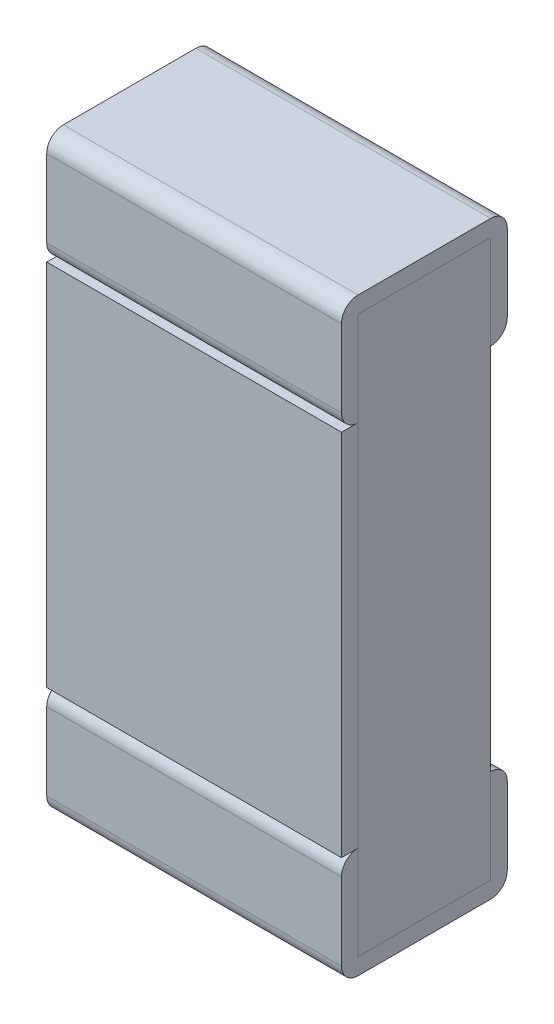
ISO-10303-21;
HEADER;
FILE_DESCRIPTION(('STEP AP214'),'2;1');
FILE_NAME('part.step','',(''),(''),'','','');
FILE_SCHEMA(('AUTOMOTIVE_DESIGN { 1 0 10303 214 1 1 1 1 }'));
ENDSEC;
DATA;
#1=APPLICATION_CONTEXT('core data for automotive mechanical design processes');
#2=APPLICATION_PROTOCOL_DEFINITION('international standard','automotive_design',2000,#1);
#3=PRODUCT_CONTEXT('',#1,'mechanical');
#4=PRODUCT('Part','Part','',(#3));
#5=PRODUCT_RELATED_PRODUCT_CATEGORY('part','',(#4));
#6=PRODUCT_DEFINITION_FORMATION('','',#4);
#7=PRODUCT_DEFINITION_CONTEXT('part definition',#1,'design');
#8=PRODUCT_DEFINITION('design','',#6,#7);
#9=PRODUCT_DEFINITION_SHAPE('','',#8);
#10=(LENGTH_UNIT() NAMED_UNIT(*) SI_UNIT(.MILLI.,.METRE.));
#11=(NAMED_UNIT(*) PLANE_ANGLE_UNIT() SI_UNIT($,.RADIAN.));
#12=(NAMED_UNIT(*) SI_UNIT($,.STERADIAN.) SOLID_ANGLE_UNIT());
#13=UNCERTAINTY_MEASURE_WITH_UNIT(LENGTH_MEASURE(1.E-05),#10,'distance_accuracy_value','');
#14=(GEOMETRIC_REPRESENTATION_CONTEXT(3) GLOBAL_UNCERTAINTY_ASSIGNED_CONTEXT((#13)) GLOBAL_UNIT_ASSIGNED_CONTEXT((#10,
#11,#12)) REPRESENTATION_CONTEXT('',''));
#15=CARTESIAN_POINT('',(0.,0.,0.));
#16=DIRECTION('',(0.,0.,1.));
#17=DIRECTION('',(1.,0.,0.));
#18=AXIS2_PLACEMENT_3D('',#15,#16,#17);
#19=CARTESIAN_POINT('',(146.144744279938,106.47204329235,142.661582908599));
#20=DIRECTION('',(0.,0.,1.));
#21=DIRECTION('',(1.,0.,0.));
#22=AXIS2_PLACEMENT_3D('',#19,#20,#21);
#23=PLANE('',#22);
#24=DIRECTION('',(1.,0.,0.));
#25=VECTOR('',#24,1.);
#26=CARTESIAN_POINT('',(146.144744279938,106.47204329235,142.661582908599));
#27=LINE('',#26,#25);
#28=CARTESIAN_POINT('',(146.144744279938,106.47204329235,142.661582908599));
#29=VERTEX_POINT('',#28);
#30=CARTESIAN_POINT('',(146.944744279938,106.47204329235,142.661582908599));
#31=VERTEX_POINT('',#30);
#32=EDGE_CURVE('E67',#29,#31,#27,.T.);
#33=ORIENTED_EDGE('',*,*,#32,.F.);
#34=DIRECTION('',(0.,-1.,0.));
#35=VECTOR('',#34,1.);
#36=CARTESIAN_POINT('',(146.144744279938,106.47204329235,142.661582908599));
#37=LINE('',#36,#35);
#38=CARTESIAN_POINT('',(146.144744279938,105.47204329235,142.661582908599));
#39=VERTEX_POINT('',#38);
#40=EDGE_CURVE('E11',#29,#39,#37,.T.);
#41=ORIENTED_EDGE('',*,*,#40,.T.);
#42=DIRECTION('',(1.,0.,0.));
#43=VECTOR('',#42,1.);
#44=CARTESIAN_POINT('',(146.144744279938,105.47204329235,142.661582908599));
#45=LINE('',#44,#43);
#46=CARTESIAN_POINT('',(146.944744279938,105.47204329235,142.661582908599));
#47=VERTEX_POINT('',#46);
#48=EDGE_CURVE('E55',#39,#47,#45,.T.);
#49=ORIENTED_EDGE('',*,*,#48,.T.);
#50=DIRECTION('',(0.,-1.,0.));
#51=VECTOR('',#50,1.);
#52=CARTESIAN_POINT('',(146.944744279938,106.47204329235,142.661582908599));
#53=LINE('',#52,#51);
#54=EDGE_CURVE('E412',#31,#47,#53,.T.);
#55=ORIENTED_EDGE('',*,*,#54,.F.);
#56=EDGE_LOOP('',(#33,#41,#49,#55));
#57=FACE_BOUND('',#56,.T.);
#58=ADVANCED_FACE('F44',(#57),#23,.T.);
#59=CARTESIAN_POINT('',(146.144744279938,105.47204329235,142.616582908599));
#60=DIRECTION('',(0.,-1.,0.));
#61=DIRECTION('',(0.,0.,-1.));
#62=AXIS2_PLACEMENT_3D('',#59,#60,#61);
#63=PLANE('',#62);
#64=DIRECTION('',(0.,0.,1.));
#65=VECTOR('',#64,1.);
#66=CARTESIAN_POINT('',(146.144744279938,105.47204329235,142.616582908599));
#67=LINE('',#66,#65);
#68=CARTESIAN_POINT('',(146.144744279938,105.47204329235,142.616582908599));
#69=VERTEX_POINT('',#68);
#70=EDGE_CURVE('E446',#69,#39,#67,.T.);
#71=ORIENTED_EDGE('',*,*,#70,.F.);
#72=DIRECTION('',(1.,0.,0.));
#73=VECTOR('',#72,1.);
#74=CARTESIAN_POINT('',(146.144744279938,105.47204329235,142.616582908599));
#75=LINE('',#74,#73);
#76=CARTESIAN_POINT('',(146.944744279938,105.47204329235,142.616582908599));
#77=VERTEX_POINT('',#76);
#78=EDGE_CURVE('E329',#69,#77,#75,.T.);
#79=ORIENTED_EDGE('',*,*,#78,.T.);
#80=DIRECTION('',(0.,0.,1.));
#81=VECTOR('',#80,1.);
#82=CARTESIAN_POINT('',(146.944744279938,105.47204329235,142.616582908599));
#83=LINE('',#82,#81);
#84=EDGE_CURVE('E325',#77,#47,#83,.T.);
#85=ORIENTED_EDGE('',*,*,#84,.T.);
#86=ORIENTED_EDGE('',*,*,#48,.F.);
#87=EDGE_LOOP('',(#71,#79,#85,#86));
#88=FACE_BOUND('',#87,.T.);
#89=ADVANCED_FACE('F564',(#88),#63,.T.);
#90=CARTESIAN_POINT('',(146.144744279938,105.42704329235,142.616582908599));
#91=DIRECTION('',(1.,0.,0.));
#92=DIRECTION('',(0.,1.,0.));
#93=AXIS2_PLACEMENT_3D('',#90,#91,#92);
#94=CYLINDRICAL_SURFACE('',#93,0.0450000000000034);
#95=CARTESIAN_POINT('',(146.144744279938,105.42704329235,142.616582908599));
#96=DIRECTION('',(1.,0.,0.));
#97=DIRECTION('',(0.,0.,1.));
#98=AXIS2_PLACEMENT_3D('',#95,#96,#97);
#99=CIRCLE('',#98,0.0449999999999895);
#100=CARTESIAN_POINT('',(146.144744279938,105.42704329235,142.661582908599));
#101=VERTEX_POINT('',#100);
#102=EDGE_CURVE('E48',#69,#101,#99,.T.);
#103=ORIENTED_EDGE('',*,*,#102,.T.);
#104=DIRECTION('',(1.,0.,0.));
#105=VECTOR('',#104,1.);
#106=CARTESIAN_POINT('',(146.144744279938,105.42704329235,142.661582908599));
#107=LINE('',#106,#105);
#108=CARTESIAN_POINT('',(146.944744279938,105.42704329235,142.661582908599));
#109=VERTEX_POINT('',#108);
#110=EDGE_CURVE('E370',#101,#109,#107,.T.);
#111=ORIENTED_EDGE('',*,*,#110,.T.);
#112=CARTESIAN_POINT('',(146.944744279938,105.42704329235,142.616582908599));
#113=DIRECTION('',(1.,0.,0.));
#114=DIRECTION('',(0.,0.,1.));
#115=AXIS2_PLACEMENT_3D('',#112,#113,#114);
#116=CIRCLE('',#115,0.0449999999999895);
#117=EDGE_CURVE('E127',#77,#109,#116,.T.);
#118=ORIENTED_EDGE('',*,*,#117,.F.);
#119=ORIENTED_EDGE('',*,*,#78,.F.);
#120=EDGE_LOOP('',(#103,#111,#118,#119));
#121=FACE_BOUND('',#120,.T.);
#122=ADVANCED_FACE('F569',(#121),#94,.T.);
#123=CARTESIAN_POINT('',(146.144744279938,105.47204329235,142.661582908599));
#124=DIRECTION('',(0.,0.,1.));
#125=DIRECTION('',(1.,0.,0.));
#126=AXIS2_PLACEMENT_3D('',#123,#124,#125);
#127=PLANE('',#126);
#128=DIRECTION('',(0.,-1.,0.));
#129=VECTOR('',#128,1.);
#130=CARTESIAN_POINT('',(146.944744279938,105.47204329235,142.661582908599));
#131=LINE('',#130,#129);
#132=CARTESIAN_POINT('',(146.944744279938,105.21704329235,142.661582908599));
#133=VERTEX_POINT('',#132);
#134=EDGE_CURVE('E294',#109,#133,#131,.T.);
#135=ORIENTED_EDGE('',*,*,#134,.F.);
#136=ORIENTED_EDGE('',*,*,#110,.F.);
#137=DIRECTION('',(0.,-1.,0.));
#138=VECTOR('',#137,1.);
#139=CARTESIAN_POINT('',(146.144744279938,105.47204329235,142.661582908599));
#140=LINE('',#139,#138);
#141=CARTESIAN_POINT('',(146.144744279938,105.21704329235,142.661582908599));
#142=VERTEX_POINT('',#141);
#143=EDGE_CURVE('E373',#101,#142,#140,.T.);
#144=ORIENTED_EDGE('',*,*,#143,.T.);
#145=DIRECTION('',(1.,0.,0.));
#146=VECTOR('',#145,1.);
#147=CARTESIAN_POINT('',(146.144744279938,105.21704329235,142.661582908599));
#148=LINE('',#147,#146);
#149=EDGE_CURVE('E143',#142,#133,#148,.T.);
#150=ORIENTED_EDGE('',*,*,#149,.T.);
#151=EDGE_LOOP('',(#135,#136,#144,#150));
#152=FACE_BOUND('',#151,.T.);
#153=ADVANCED_FACE('F46',(#152),#127,.T.);
#154=CARTESIAN_POINT('',(146.144744279938,105.21704329235,142.616582908599));
#155=DIRECTION('',(1.,0.,0.));
#156=DIRECTION('',(0.,-1.,0.));
#157=AXIS2_PLACEMENT_3D('',#154,#155,#156);
#158=CYLINDRICAL_SURFACE('',#157,0.0450000000000034);
#159=DIRECTION('',(1.,0.,0.));
#160=VECTOR('',#159,1.);
#161=CARTESIAN_POINT('',(146.144744279938,105.17204329235,142.616582908599));
#162=LINE('',#161,#160);
#163=CARTESIAN_POINT('',(146.144744279938,105.17204329235,142.616582908599));
#164=VERTEX_POINT('',#163);
#165=CARTESIAN_POINT('',(146.944744279938,105.17204329235,142.616582908599));
#166=VERTEX_POINT('',#165);
#167=EDGE_CURVE('E316',#164,#166,#162,.T.);
#168=ORIENTED_EDGE('',*,*,#167,.T.);
#169=CARTESIAN_POINT('',(146.944744279938,105.21704329235,142.616582908599));
#170=DIRECTION('',(-1.,0.,0.));
#171=DIRECTION('',(0.,0.,1.));
#172=AXIS2_PLACEMENT_3D('',#169,#170,#171);
#173=CIRCLE('',#172,0.0449999999999895);
#174=EDGE_CURVE('E273',#166,#133,#173,.T.);
#175=ORIENTED_EDGE('',*,*,#174,.T.);
#176=ORIENTED_EDGE('',*,*,#149,.F.);
#177=CARTESIAN_POINT('',(146.144744279938,105.21704329235,142.616582908599));
#178=DIRECTION('',(-1.,0.,0.));
#179=DIRECTION('',(0.,0.,1.));
#180=AXIS2_PLACEMENT_3D('',#177,#178,#179);
#181=CIRCLE('',#180,0.0449999999999895);
#182=EDGE_CURVE('E432',#164,#142,#181,.T.);
#183=ORIENTED_EDGE('',*,*,#182,.F.);
#184=EDGE_LOOP('',(#168,#175,#176,#183));
#185=FACE_BOUND('',#184,.T.);
#186=ADVANCED_FACE('F589',(#185),#158,.T.);
#187=CARTESIAN_POINT('',(146.144744279938,105.17204329235,142.211582908599));
#188=DIRECTION('',(0.,-1.,0.));
#189=DIRECTION('',(0.,0.,-1.));
#190=AXIS2_PLACEMENT_3D('',#187,#188,#189);
#191=PLANE('',#190);
#192=DIRECTION('',(0.,0.,1.));
#193=VECTOR('',#192,1.);
#194=CARTESIAN_POINT('',(146.144744279938,105.17204329235,142.211582908599));
#195=LINE('',#194,#193);
#196=CARTESIAN_POINT('',(146.144744279938,105.17204329235,142.256582908599));
#197=VERTEX_POINT('',#196);
#198=EDGE_CURVE('E284',#197,#164,#195,.T.);
#199=ORIENTED_EDGE('',*,*,#198,.F.);
#200=DIRECTION('',(1.,0.,0.));
#201=VECTOR('',#200,1.);
#202=CARTESIAN_POINT('',(146.144744279938,105.17204329235,142.256582908599));
#203=LINE('',#202,#201);
#204=CARTESIAN_POINT('',(146.944744279938,105.17204329235,142.256582908599));
#205=VERTEX_POINT('',#204);
#206=EDGE_CURVE('E278',#197,#205,#203,.T.);
#207=ORIENTED_EDGE('',*,*,#206,.T.);
#208=DIRECTION('',(0.,0.,1.));
#209=VECTOR('',#208,1.);
#210=CARTESIAN_POINT('',(146.944744279938,105.17204329235,142.211582908599));
#211=LINE('',#210,#209);
#212=EDGE_CURVE('E267',#205,#166,#211,.T.);
#213=ORIENTED_EDGE('',*,*,#212,.T.);
#214=ORIENTED_EDGE('',*,*,#167,.F.);
#215=EDGE_LOOP('',(#199,#207,#213,#214));
#216=FACE_BOUND('',#215,.T.);
#217=ADVANCED_FACE('F282',(#216),#191,.T.);
#218=CARTESIAN_POINT('',(146.144744279938,105.21704329235,142.256582908599));
#219=DIRECTION('',(1.,0.,0.));
#220=DIRECTION('',(0.,-1.,0.));
#221=AXIS2_PLACEMENT_3D('',#218,#219,#220);
#222=CYLINDRICAL_SURFACE('',#221,0.0450000000000034);
#223=CARTESIAN_POINT('',(146.144744279938,105.21704329235,142.256582908599));
#224=DIRECTION('',(1.,0.,0.));
#225=DIRECTION('',(0.,0.,1.));
#226=AXIS2_PLACEMENT_3D('',#223,#224,#225);
#227=CIRCLE('',#226,0.0449999999999895);
#228=CARTESIAN_POINT('',(146.144744279938,105.21704329235,142.211582908599));
#229=VERTEX_POINT('',#228);
#230=EDGE_CURVE('E279',#197,#229,#227,.T.);
#231=ORIENTED_EDGE('',*,*,#230,.T.);
#232=DIRECTION('',(1.,0.,0.));
#233=VECTOR('',#232,1.);
#234=CARTESIAN_POINT('',(146.144744279938,105.21704329235,142.211582908599));
#235=LINE('',#234,#233);
#236=CARTESIAN_POINT('',(146.944744279938,105.21704329235,142.211582908599));
#237=VERTEX_POINT('',#236);
#238=EDGE_CURVE('E291',#229,#237,#235,.T.);
#239=ORIENTED_EDGE('',*,*,#238,.T.);
#240=CARTESIAN_POINT('',(146.944744279938,105.21704329235,142.256582908599));
#241=DIRECTION('',(1.,0.,0.));
#242=DIRECTION('',(0.,0.,1.));
#243=AXIS2_PLACEMENT_3D('',#240,#241,#242);
#244=CIRCLE('',#243,0.0449999999999895);
#245=EDGE_CURVE('E271',#205,#237,#244,.T.);
#246=ORIENTED_EDGE('',*,*,#245,.F.);
#247=ORIENTED_EDGE('',*,*,#206,.F.);
#248=EDGE_LOOP('',(#231,#239,#246,#247));
#249=FACE_BOUND('',#248,.T.);
#250=ADVANCED_FACE('F290',(#249),#222,.T.);
#251=CARTESIAN_POINT('',(146.144744279938,105.47204329235,142.211582908599));
#252=DIRECTION('',(0.,0.,1.));
#253=DIRECTION('',(1.,0.,0.));
#254=AXIS2_PLACEMENT_3D('',#251,#252,#253);
#255=PLANE('',#254);
#256=ORIENTED_EDGE('',*,*,#238,.F.);
#257=DIRECTION('',(0.,-1.,0.));
#258=VECTOR('',#257,1.);
#259=CARTESIAN_POINT('',(146.144744279938,105.47204329235,142.211582908599));
#260=LINE('',#259,#258);
#261=CARTESIAN_POINT('',(146.144744279938,105.42704329235,142.211582908599));
#262=VERTEX_POINT('',#261);
#263=EDGE_CURVE('E307',#262,#229,#260,.T.);
#264=ORIENTED_EDGE('',*,*,#263,.F.);
#265=DIRECTION('',(1.,0.,0.));
#266=VECTOR('',#265,1.);
#267=CARTESIAN_POINT('',(146.144744279938,105.42704329235,142.211582908599));
#268=LINE('',#267,#266);
#269=CARTESIAN_POINT('',(146.944744279938,105.42704329235,142.211582908599));
#270=VERTEX_POINT('',#269);
#271=EDGE_CURVE('E351',#262,#270,#268,.T.);
#272=ORIENTED_EDGE('',*,*,#271,.T.);
#273=DIRECTION('',(0.,-1.,0.));
#274=VECTOR('',#273,1.);
#275=CARTESIAN_POINT('',(146.944744279938,105.47204329235,142.211582908599));
#276=LINE('',#275,#274);
#277=EDGE_CURVE('E408',#270,#237,#276,.T.);
#278=ORIENTED_EDGE('',*,*,#277,.T.);
#279=EDGE_LOOP('',(#256,#264,#272,#278));
#280=FACE_BOUND('',#279,.T.);
#281=ADVANCED_FACE('F584',(#280),#255,.F.);
#282=CARTESIAN_POINT('',(146.144744279938,105.42704329235,142.256582908599));
#283=DIRECTION('',(1.,0.,0.));
#284=DIRECTION('',(0.,1.,0.));
#285=AXIS2_PLACEMENT_3D('',#282,#283,#284);
#286=CYLINDRICAL_SURFACE('',#285,0.0450000000000034);
#287=DIRECTION('',(1.,0.,0.));
#288=VECTOR('',#287,1.);
#289=CARTESIAN_POINT('',(146.144744279938,105.47204329235,142.256582908599));
#290=LINE('',#289,#288);
#291=CARTESIAN_POINT('',(146.144744279938,105.47204329235,142.256582908599));
#292=VERTEX_POINT('',#291);
#293=CARTESIAN_POINT('',(146.944744279938,105.47204329235,142.256582908599));
#294=VERTEX_POINT('',#293);
#295=EDGE_CURVE('E396',#292,#294,#290,.T.);
#296=ORIENTED_EDGE('',*,*,#295,.T.);
#297=CARTESIAN_POINT('',(146.944744279938,105.42704329235,142.256582908599));
#298=DIRECTION('',(-1.,0.,0.));
#299=DIRECTION('',(0.,0.,1.));
#300=AXIS2_PLACEMENT_3D('',#297,#298,#299);
#301=CIRCLE('',#300,0.0449999999999895);
#302=EDGE_CURVE('E392',#294,#270,#301,.T.);
#303=ORIENTED_EDGE('',*,*,#302,.T.);
#304=ORIENTED_EDGE('',*,*,#271,.F.);
#305=CARTESIAN_POINT('',(146.144744279938,105.42704329235,142.256582908599));
#306=DIRECTION('',(-1.,0.,0.));
#307=DIRECTION('',(0.,0.,1.));
#308=AXIS2_PLACEMENT_3D('',#305,#306,#307);
#309=CIRCLE('',#308,0.0449999999999895);
#310=EDGE_CURVE('E310',#292,#262,#309,.T.);
#311=ORIENTED_EDGE('',*,*,#310,.F.);
#312=EDGE_LOOP('',(#296,#303,#304,#311));
#313=FACE_BOUND('',#312,.T.);
#314=ADVANCED_FACE('F512',(#313),#286,.T.);
#315=CARTESIAN_POINT('',(146.944744279938,106.47204329235,142.616582908599));
#316=DIRECTION('',(1.,0.,0.));
#317=DIRECTION('',(0.,1.,0.));
#318=AXIS2_PLACEMENT_3D('',#315,#316,#317);
#319=PLANE('',#318);
#320=DIRECTION('',(0.,-1.,0.));
#321=VECTOR('',#320,1.);
#322=CARTESIAN_POINT('',(146.944744279938,106.47204329235,142.616582908599));
#323=LINE('',#322,#321);
#324=CARTESIAN_POINT('',(146.944744279938,106.47204329235,142.616582908599));
#325=VERTEX_POINT('',#324);
#326=EDGE_CURVE('E354',#325,#77,#323,.T.);
#327=ORIENTED_EDGE('',*,*,#326,.F.);
#328=DIRECTION('',(0.,0.,1.));
#329=VECTOR('',#328,1.);
#330=CARTESIAN_POINT('',(146.944744279938,106.47204329235,142.616582908599));
#331=LINE('',#330,#329);
#332=EDGE_CURVE('E397',#325,#31,#331,.T.);
#333=ORIENTED_EDGE('',*,*,#332,.T.);
#334=ORIENTED_EDGE('',*,*,#54,.T.);
#335=ORIENTED_EDGE('',*,*,#84,.F.);
#336=EDGE_LOOP('',(#327,#333,#334,#335));
#337=FACE_BOUND('',#336,.T.);
#338=ADVANCED_FACE('F526',(#337),#319,.T.);
#339=CARTESIAN_POINT('',(146.944744279938,105.47204329235,142.211582908599));
#340=DIRECTION('',(1.,0.,0.));
#341=DIRECTION('',(0.,1.,0.));
#342=AXIS2_PLACEMENT_3D('',#339,#340,#341);
#343=PLANE('',#342);
#344=ORIENTED_EDGE('',*,*,#277,.F.);
#345=ORIENTED_EDGE('',*,*,#302,.F.);
#346=DIRECTION('',(0.,-1.,0.));
#347=VECTOR('',#346,1.);
#348=CARTESIAN_POINT('',(146.944744279938,106.72704329235,142.256582908599));
#349=LINE('',#348,#347);
#350=CARTESIAN_POINT('',(146.944744279938,105.21704329235,142.256582908599));
#351=VERTEX_POINT('',#350);
#352=EDGE_CURVE('E379',#294,#351,#349,.T.);
#353=ORIENTED_EDGE('',*,*,#352,.T.);
#354=DIRECTION('',(0.,0.,1.));
#355=VECTOR('',#354,1.);
#356=CARTESIAN_POINT('',(146.944744279938,105.21704329235,142.256582908599));
#357=LINE('',#356,#355);
#358=CARTESIAN_POINT('',(146.944744279938,105.21704329235,142.616582908599));
#359=VERTEX_POINT('',#358);
#360=EDGE_CURVE('E376',#351,#359,#357,.T.);
#361=ORIENTED_EDGE('',*,*,#360,.T.);
#362=DIRECTION('',(0.,-1.,0.));
#363=VECTOR('',#362,1.);
#364=CARTESIAN_POINT('',(146.944744279938,106.72704329235,142.616582908599));
#365=LINE('',#364,#363);
#366=EDGE_CURVE('E460',#77,#359,#365,.T.);
#367=ORIENTED_EDGE('',*,*,#366,.F.);
#368=ORIENTED_EDGE('',*,*,#117,.T.);
#369=ORIENTED_EDGE('',*,*,#134,.T.);
#370=ORIENTED_EDGE('',*,*,#174,.F.);
#371=ORIENTED_EDGE('',*,*,#212,.F.);
#372=ORIENTED_EDGE('',*,*,#245,.T.);
#373=EDGE_LOOP('',(#344,#345,#353,#361,#367,#368,#369,#370,#371,#372));
#374=FACE_BOUND('',#373,.T.);
#375=ADVANCED_FACE('F269',(#374),#343,.T.);
#376=CARTESIAN_POINT('',(146.144744279938,106.47204329235,142.616582908599));
#377=DIRECTION('',(0.,-1.,0.));
#378=DIRECTION('',(0.,0.,-1.));
#379=AXIS2_PLACEMENT_3D('',#376,#377,#378);
#380=PLANE('',#379);
#381=ORIENTED_EDGE('',*,*,#32,.T.);
#382=ORIENTED_EDGE('',*,*,#332,.F.);
#383=DIRECTION('',(1.,0.,0.));
#384=VECTOR('',#383,1.);
#385=CARTESIAN_POINT('',(146.144744279938,106.47204329235,142.616582908599));
#386=LINE('',#385,#384);
#387=CARTESIAN_POINT('',(146.144744279938,106.47204329235,142.616582908599));
#388=VERTEX_POINT('',#387);
#389=EDGE_CURVE('E220',#388,#325,#386,.T.);
#390=ORIENTED_EDGE('',*,*,#389,.F.);
#391=DIRECTION('',(0.,0.,1.));
#392=VECTOR('',#391,1.);
#393=CARTESIAN_POINT('',(146.144744279938,106.47204329235,142.616582908599));
#394=LINE('',#393,#392);
#395=EDGE_CURVE('E302',#388,#29,#394,.T.);
#396=ORIENTED_EDGE('',*,*,#395,.T.);
#397=EDGE_LOOP('',(#381,#382,#390,#396));
#398=FACE_BOUND('',#397,.T.);
#399=ADVANCED_FACE('F530',(#398),#380,.F.);
#400=CARTESIAN_POINT('',(146.144744279938,106.47204329235,142.616582908599));
#401=DIRECTION('',(1.,0.,0.));
#402=DIRECTION('',(0.,1.,0.));
#403=AXIS2_PLACEMENT_3D('',#400,#401,#402);
#404=PLANE('',#403);
#405=ORIENTED_EDGE('',*,*,#70,.T.);
#406=ORIENTED_EDGE('',*,*,#40,.F.);
#407=ORIENTED_EDGE('',*,*,#395,.F.);
#408=DIRECTION('',(0.,-1.,0.));
#409=VECTOR('',#408,1.);
#410=CARTESIAN_POINT('',(146.144744279938,106.47204329235,142.616582908599));
#411=LINE('',#410,#409);
#412=EDGE_CURVE('E443',#388,#69,#411,.T.);
#413=ORIENTED_EDGE('',*,*,#412,.T.);
#414=EDGE_LOOP('',(#405,#406,#407,#413));
#415=FACE_BOUND('',#414,.T.);
#416=ADVANCED_FACE('F660',(#415),#404,.F.);
#417=CARTESIAN_POINT('',(146.144744279938,105.47204329235,142.211582908599));
#418=DIRECTION('',(1.,0.,0.));
#419=DIRECTION('',(0.,1.,0.));
#420=AXIS2_PLACEMENT_3D('',#417,#418,#419);
#421=PLANE('',#420);
#422=ORIENTED_EDGE('',*,*,#230,.F.);
#423=ORIENTED_EDGE('',*,*,#198,.T.);
#424=ORIENTED_EDGE('',*,*,#182,.T.);
#425=ORIENTED_EDGE('',*,*,#143,.F.);
#426=ORIENTED_EDGE('',*,*,#102,.F.);
#427=DIRECTION('',(0.,-1.,0.));
#428=VECTOR('',#427,1.);
#429=CARTESIAN_POINT('',(146.144744279938,106.72704329235,142.616582908599));
#430=LINE('',#429,#428);
#431=CARTESIAN_POINT('',(146.144744279938,105.21704329235,142.616582908599));
#432=VERTEX_POINT('',#431);
#433=EDGE_CURVE('E249',#69,#432,#430,.T.);
#434=ORIENTED_EDGE('',*,*,#433,.T.);
#435=DIRECTION('',(0.,0.,1.));
#436=VECTOR('',#435,1.);
#437=CARTESIAN_POINT('',(146.144744279938,105.21704329235,142.256582908599));
#438=LINE('',#437,#436);
#439=CARTESIAN_POINT('',(146.144744279938,105.21704329235,142.256582908599));
#440=VERTEX_POINT('',#439);
#441=EDGE_CURVE('E380',#440,#432,#438,.T.);
#442=ORIENTED_EDGE('',*,*,#441,.F.);
#443=DIRECTION('',(0.,-1.,0.));
#444=VECTOR('',#443,1.);
#445=CARTESIAN_POINT('',(146.144744279938,106.72704329235,142.256582908599));
#446=LINE('',#445,#444);
#447=EDGE_CURVE('E207',#292,#440,#446,.T.);
#448=ORIENTED_EDGE('',*,*,#447,.F.);
#449=ORIENTED_EDGE('',*,*,#310,.T.);
#450=ORIENTED_EDGE('',*,*,#263,.T.);
#451=EDGE_LOOP('',(#422,#423,#424,#425,#426,#434,#442,#448,#449,#450));
#452=FACE_BOUND('',#451,.T.);
#453=ADVANCED_FACE('F578',(#452),#421,.F.);
#454=CARTESIAN_POINT('',(146.144744279938,106.72704329235,142.256582908599));
#455=DIRECTION('',(0.,0.,1.));
#456=DIRECTION('',(1.,0.,0.));
#457=AXIS2_PLACEMENT_3D('',#454,#455,#456);
#458=PLANE('',#457);
#459=DIRECTION('',(0.,-1.,0.));
#460=VECTOR('',#459,1.);
#461=CARTESIAN_POINT('',(146.944744279938,106.72704329235,142.256582908599));
#462=LINE('',#461,#460);
#463=CARTESIAN_POINT('',(146.944744279938,106.47204329235,142.256582908599));
#464=VERTEX_POINT('',#463);
#465=EDGE_CURVE('E311',#464,#294,#462,.T.);
#466=ORIENTED_EDGE('',*,*,#465,.T.);
#467=ORIENTED_EDGE('',*,*,#295,.F.);
#468=DIRECTION('',(0.,-1.,0.));
#469=VECTOR('',#468,1.);
#470=CARTESIAN_POINT('',(146.144744279938,106.72704329235,142.256582908599));
#471=LINE('',#470,#469);
#472=CARTESIAN_POINT('',(146.144744279938,106.47204329235,142.256582908599));
#473=VERTEX_POINT('',#472);
#474=EDGE_CURVE('E405',#473,#292,#471,.T.);
#475=ORIENTED_EDGE('',*,*,#474,.F.);
#476=DIRECTION('',(1.,0.,0.));
#477=VECTOR('',#476,1.);
#478=CARTESIAN_POINT('',(146.144744279938,106.47204329235,142.256582908599));
#479=LINE('',#478,#477);
#480=EDGE_CURVE('E315',#473,#464,#479,.T.);
#481=ORIENTED_EDGE('',*,*,#480,.T.);
#482=EDGE_LOOP('',(#466,#467,#475,#481));
#483=FACE_BOUND('',#482,.T.);
#484=ADVANCED_FACE('F502',(#483),#458,.F.);
#485=CARTESIAN_POINT('',(146.944744279938,106.72704329235,142.256582908599));
#486=DIRECTION('',(1.,0.,0.));
#487=DIRECTION('',(0.,1.,0.));
#488=AXIS2_PLACEMENT_3D('',#485,#486,#487);
#489=PLANE('',#488);
#490=DIRECTION('',(0.,-1.,0.));
#491=VECTOR('',#490,1.);
#492=CARTESIAN_POINT('',(146.944744279938,106.72704329235,142.256582908599));
#493=LINE('',#492,#491);
#494=CARTESIAN_POINT('',(146.944744279938,106.72704329235,142.256582908599));
#495=VERTEX_POINT('',#494);
#496=EDGE_CURVE('E323',#495,#464,#493,.T.);
#497=ORIENTED_EDGE('',*,*,#496,.F.);
#498=DIRECTION('',(0.,0.,1.));
#499=VECTOR('',#498,1.);
#500=CARTESIAN_POINT('',(146.944744279938,106.72704329235,142.256582908599));
#501=LINE('',#500,#499);
#502=CARTESIAN_POINT('',(146.944744279938,106.72704329235,142.616582908599));
#503=VERTEX_POINT('',#502);
#504=EDGE_CURVE('E164',#495,#503,#501,.T.);
#505=ORIENTED_EDGE('',*,*,#504,.T.);
#506=DIRECTION('',(0.,-1.,0.));
#507=VECTOR('',#506,1.);
#508=CARTESIAN_POINT('',(146.944744279938,106.72704329235,142.616582908599));
#509=LINE('',#508,#507);
#510=EDGE_CURVE('E332',#503,#325,#509,.T.);
#511=ORIENTED_EDGE('',*,*,#510,.T.);
#512=ORIENTED_EDGE('',*,*,#326,.T.);
#513=ORIENTED_EDGE('',*,*,#366,.T.);
#514=ORIENTED_EDGE('',*,*,#360,.F.);
#515=ORIENTED_EDGE('',*,*,#352,.F.);
#516=ORIENTED_EDGE('',*,*,#465,.F.);
#517=EDGE_LOOP('',(#497,#505,#511,#512,#513,#514,#515,#516));
#518=FACE_BOUND('',#517,.T.);
#519=ADVANCED_FACE('F506',(#518),#489,.T.);
#520=CARTESIAN_POINT('',(146.144744279938,106.51704329235,142.616582908599));
#521=DIRECTION('',(1.,0.,0.));
#522=DIRECTION('',(0.,-1.,0.));
#523=AXIS2_PLACEMENT_3D('',#520,#521,#522);
#524=CYLINDRICAL_SURFACE('',#523,0.0450000000000034);
#525=ORIENTED_EDGE('',*,*,#389,.T.);
#526=CARTESIAN_POINT('',(146.944744279938,106.51704329235,142.616582908599));
#527=DIRECTION('',(-1.,0.,0.));
#528=DIRECTION('',(0.,0.,1.));
#529=AXIS2_PLACEMENT_3D('',#526,#527,#528);
#530=CIRCLE('',#529,0.0449999999999895);
#531=CARTESIAN_POINT('',(146.944744279938,106.51704329235,142.661582908599));
#532=VERTEX_POINT('',#531);
#533=EDGE_CURVE('E355',#325,#532,#530,.T.);
#534=ORIENTED_EDGE('',*,*,#533,.T.);
#535=DIRECTION('',(1.,0.,0.));
#536=VECTOR('',#535,1.);
#537=CARTESIAN_POINT('',(146.144744279938,106.51704329235,142.661582908599));
#538=LINE('',#537,#536);
#539=CARTESIAN_POINT('',(146.144744279938,106.51704329235,142.661582908599));
#540=VERTEX_POINT('',#539);
#541=EDGE_CURVE('E176',#540,#532,#538,.T.);
#542=ORIENTED_EDGE('',*,*,#541,.F.);
#543=CARTESIAN_POINT('',(146.144744279938,106.51704329235,142.616582908599));
#544=DIRECTION('',(-1.,0.,0.));
#545=DIRECTION('',(0.,0.,1.));
#546=AXIS2_PLACEMENT_3D('',#543,#544,#545);
#547=CIRCLE('',#546,0.0449999999999895);
#548=EDGE_CURVE('E237',#388,#540,#547,.T.);
#549=ORIENTED_EDGE('',*,*,#548,.F.);
#550=EDGE_LOOP('',(#525,#534,#542,#549));
#551=FACE_BOUND('',#550,.T.);
#552=ADVANCED_FACE('F533',(#551),#524,.T.);
#553=CARTESIAN_POINT('',(146.144744279938,106.77204329235,142.661582908599));
#554=DIRECTION('',(0.,0.,1.));
#555=DIRECTION('',(1.,0.,0.));
#556=AXIS2_PLACEMENT_3D('',#553,#554,#555);
#557=PLANE('',#556);
#558=DIRECTION('',(0.,-1.,0.));
#559=VECTOR('',#558,1.);
#560=CARTESIAN_POINT('',(146.944744279938,106.77204329235,142.661582908599));
#561=LINE('',#560,#559);
#562=CARTESIAN_POINT('',(146.944744279938,106.72704329235,142.661582908599));
#563=VERTEX_POINT('',#562);
#564=EDGE_CURVE('E319',#563,#532,#561,.T.);
#565=ORIENTED_EDGE('',*,*,#564,.F.);
#566=DIRECTION('',(1.,0.,0.));
#567=VECTOR('',#566,1.);
#568=CARTESIAN_POINT('',(146.144744279938,106.72704329235,142.661582908599));
#569=LINE('',#568,#567);
#570=CARTESIAN_POINT('',(146.144744279938,106.72704329235,142.661582908599));
#571=VERTEX_POINT('',#570);
#572=EDGE_CURVE('E339',#571,#563,#569,.T.);
#573=ORIENTED_EDGE('',*,*,#572,.F.);
#574=DIRECTION('',(0.,-1.,0.));
#575=VECTOR('',#574,1.);
#576=CARTESIAN_POINT('',(146.144744279938,106.77204329235,142.661582908599));
#577=LINE('',#576,#575);
#578=EDGE_CURVE('E358',#571,#540,#577,.T.);
#579=ORIENTED_EDGE('',*,*,#578,.T.);
#580=ORIENTED_EDGE('',*,*,#541,.T.);
#581=EDGE_LOOP('',(#565,#573,#579,#580));
#582=FACE_BOUND('',#581,.T.);
#583=ADVANCED_FACE('F536',(#582),#557,.T.);
#584=CARTESIAN_POINT('',(146.144744279938,106.72704329235,142.256582908599));
#585=DIRECTION('',(1.,0.,0.));
#586=DIRECTION('',(0.,1.,0.));
#587=AXIS2_PLACEMENT_3D('',#584,#585,#586);
#588=PLANE('',#587);
#589=ORIENTED_EDGE('',*,*,#474,.T.);
#590=ORIENTED_EDGE('',*,*,#447,.T.);
#591=ORIENTED_EDGE('',*,*,#441,.T.);
#592=ORIENTED_EDGE('',*,*,#433,.F.);
#593=ORIENTED_EDGE('',*,*,#412,.F.);
#594=DIRECTION('',(0.,-1.,0.));
#595=VECTOR('',#594,1.);
#596=CARTESIAN_POINT('',(146.144744279938,106.72704329235,142.616582908599));
#597=LINE('',#596,#595);
#598=CARTESIAN_POINT('',(146.144744279938,106.72704329235,142.616582908599));
#599=VERTEX_POINT('',#598);
#600=EDGE_CURVE('E450',#599,#388,#597,.T.);
#601=ORIENTED_EDGE('',*,*,#600,.F.);
#602=DIRECTION('',(0.,0.,1.));
#603=VECTOR('',#602,1.);
#604=CARTESIAN_POINT('',(146.144744279938,106.72704329235,142.256582908599));
#605=LINE('',#604,#603);
#606=CARTESIAN_POINT('',(146.144744279938,106.72704329235,142.256582908599));
#607=VERTEX_POINT('',#606);
#608=EDGE_CURVE('E338',#607,#599,#605,.T.);
#609=ORIENTED_EDGE('',*,*,#608,.F.);
#610=DIRECTION('',(0.,-1.,0.));
#611=VECTOR('',#610,1.);
#612=CARTESIAN_POINT('',(146.144744279938,106.72704329235,142.256582908599));
#613=LINE('',#612,#611);
#614=EDGE_CURVE('E383',#607,#473,#613,.T.);
#615=ORIENTED_EDGE('',*,*,#614,.T.);
#616=EDGE_LOOP('',(#589,#590,#591,#592,#593,#601,#609,#615));
#617=FACE_BOUND('',#616,.T.);
#618=ADVANCED_FACE('F575',(#617),#588,.F.);
#619=CARTESIAN_POINT('',(146.144744279938,106.51704329235,142.256582908599));
#620=DIRECTION('',(1.,0.,0.));
#621=DIRECTION('',(0.,-1.,0.));
#622=AXIS2_PLACEMENT_3D('',#619,#620,#621);
#623=CYLINDRICAL_SURFACE('',#622,0.0450000000000034);
#624=CARTESIAN_POINT('',(146.144744279938,106.51704329235,142.256582908599));
#625=DIRECTION('',(1.,0.,0.));
#626=DIRECTION('',(0.,0.,1.));
#627=AXIS2_PLACEMENT_3D('',#624,#625,#626);
#628=CIRCLE('',#627,0.0449999999999895);
#629=CARTESIAN_POINT('',(146.144744279938,106.51704329235,142.211582908599));
#630=VERTEX_POINT('',#629);
#631=EDGE_CURVE('E423',#473,#630,#628,.T.);
#632=ORIENTED_EDGE('',*,*,#631,.T.);
#633=DIRECTION('',(1.,0.,0.));
#634=VECTOR('',#633,1.);
#635=CARTESIAN_POINT('',(146.144744279938,106.51704329235,142.211582908599));
#636=LINE('',#635,#634);
#637=CARTESIAN_POINT('',(146.944744279938,106.51704329235,142.211582908599));
#638=VERTEX_POINT('',#637);
#639=EDGE_CURVE('E391',#630,#638,#636,.T.);
#640=ORIENTED_EDGE('',*,*,#639,.T.);
#641=CARTESIAN_POINT('',(146.944744279938,106.51704329235,142.256582908599));
#642=DIRECTION('',(1.,0.,0.));
#643=DIRECTION('',(0.,0.,1.));
#644=AXIS2_PLACEMENT_3D('',#641,#642,#643);
#645=CIRCLE('',#644,0.0449999999999895);
#646=EDGE_CURVE('E384',#464,#638,#645,.T.);
#647=ORIENTED_EDGE('',*,*,#646,.F.);
#648=ORIENTED_EDGE('',*,*,#480,.F.);
#649=EDGE_LOOP('',(#632,#640,#647,#648));
#650=FACE_BOUND('',#649,.T.);
#651=ADVANCED_FACE('F485',(#650),#623,.T.);
#652=CARTESIAN_POINT('',(146.144744279938,106.77204329235,142.211582908599));
#653=DIRECTION('',(0.,0.,1.));
#654=DIRECTION('',(1.,0.,0.));
#655=AXIS2_PLACEMENT_3D('',#652,#653,#654);
#656=PLANE('',#655);
#657=ORIENTED_EDGE('',*,*,#639,.F.);
#658=DIRECTION('',(0.,-1.,0.));
#659=VECTOR('',#658,1.);
#660=CARTESIAN_POINT('',(146.144744279938,106.77204329235,142.211582908599));
#661=LINE('',#660,#659);
#662=CARTESIAN_POINT('',(146.144744279938,106.72704329235,142.211582908599));
#663=VERTEX_POINT('',#662);
#664=EDGE_CURVE('E343',#663,#630,#661,.T.);
#665=ORIENTED_EDGE('',*,*,#664,.F.);
#666=DIRECTION('',(1.,0.,0.));
#667=VECTOR('',#666,1.);
#668=CARTESIAN_POINT('',(146.144744279938,106.72704329235,142.211582908599));
#669=LINE('',#668,#667);
#670=CARTESIAN_POINT('',(146.944744279938,106.72704329235,142.211582908599));
#671=VERTEX_POINT('',#670);
#672=EDGE_CURVE('E363',#663,#671,#669,.T.);
#673=ORIENTED_EDGE('',*,*,#672,.T.);
#674=DIRECTION('',(0.,-1.,0.));
#675=VECTOR('',#674,1.);
#676=CARTESIAN_POINT('',(146.944744279938,106.77204329235,142.211582908599));
#677=LINE('',#676,#675);
#678=EDGE_CURVE('E359',#671,#638,#677,.T.);
#679=ORIENTED_EDGE('',*,*,#678,.T.);
#680=EDGE_LOOP('',(#657,#665,#673,#679));
#681=FACE_BOUND('',#680,.T.);
#682=ADVANCED_FACE('F491',(#681),#656,.F.);
#683=CARTESIAN_POINT('',(146.944744279938,106.77204329235,142.211582908599));
#684=DIRECTION('',(1.,0.,0.));
#685=DIRECTION('',(0.,1.,0.));
#686=AXIS2_PLACEMENT_3D('',#683,#684,#685);
#687=PLANE('',#686);
#688=ORIENTED_EDGE('',*,*,#678,.F.);
#689=CARTESIAN_POINT('',(146.944744279938,106.72704329235,142.256582908599));
#690=DIRECTION('',(-1.,0.,0.));
#691=DIRECTION('',(0.,0.,1.));
#692=AXIS2_PLACEMENT_3D('',#689,#690,#691);
#693=CIRCLE('',#692,0.0449999999999895);
#694=CARTESIAN_POINT('',(146.944744279938,106.77204329235,142.256582908599));
#695=VERTEX_POINT('',#694);
#696=EDGE_CURVE('E333',#695,#671,#693,.T.);
#697=ORIENTED_EDGE('',*,*,#696,.F.);
#698=DIRECTION('',(0.,0.,1.));
#699=VECTOR('',#698,1.);
#700=CARTESIAN_POINT('',(146.944744279938,106.77204329235,142.211582908599));
#701=LINE('',#700,#699);
#702=CARTESIAN_POINT('',(146.944744279938,106.77204329235,142.616582908599));
#703=VERTEX_POINT('',#702);
#704=EDGE_CURVE('E364',#695,#703,#701,.T.);
#705=ORIENTED_EDGE('',*,*,#704,.T.);
#706=CARTESIAN_POINT('',(146.944744279938,106.72704329235,142.616582908599));
#707=DIRECTION('',(1.,0.,0.));
#708=DIRECTION('',(0.,0.,1.));
#709=AXIS2_PLACEMENT_3D('',#706,#707,#708);
#710=CIRCLE('',#709,0.0449999999999895);
#711=EDGE_CURVE('E322',#703,#563,#710,.T.);
#712=ORIENTED_EDGE('',*,*,#711,.T.);
#713=ORIENTED_EDGE('',*,*,#564,.T.);
#714=ORIENTED_EDGE('',*,*,#533,.F.);
#715=ORIENTED_EDGE('',*,*,#510,.F.);
#716=ORIENTED_EDGE('',*,*,#504,.F.);
#717=ORIENTED_EDGE('',*,*,#496,.T.);
#718=ORIENTED_EDGE('',*,*,#646,.T.);
#719=EDGE_LOOP('',(#688,#697,#705,#712,#713,#714,#715,#716,#717,#718));
#720=FACE_BOUND('',#719,.T.);
#721=ADVANCED_FACE('F494',(#720),#687,.T.);
#722=CARTESIAN_POINT('',(146.144744279938,106.72704329235,142.616582908599));
#723=DIRECTION('',(1.,0.,0.));
#724=DIRECTION('',(0.,1.,0.));
#725=AXIS2_PLACEMENT_3D('',#722,#723,#724);
#726=CYLINDRICAL_SURFACE('',#725,0.0450000000000034);
#727=CARTESIAN_POINT('',(146.144744279938,106.72704329235,142.616582908599));
#728=DIRECTION('',(1.,0.,0.));
#729=DIRECTION('',(0.,0.,1.));
#730=AXIS2_PLACEMENT_3D('',#727,#728,#729);
#731=CIRCLE('',#730,0.0449999999999895);
#732=CARTESIAN_POINT('',(146.144744279938,106.77204329235,142.616582908599));
#733=VERTEX_POINT('',#732);
#734=EDGE_CURVE('E342',#733,#571,#731,.T.);
#735=ORIENTED_EDGE('',*,*,#734,.T.);
#736=ORIENTED_EDGE('',*,*,#572,.T.);
#737=ORIENTED_EDGE('',*,*,#711,.F.);
#738=DIRECTION('',(1.,0.,0.));
#739=VECTOR('',#738,1.);
#740=CARTESIAN_POINT('',(146.144744279938,106.77204329235,142.616582908599));
#741=LINE('',#740,#739);
#742=EDGE_CURVE('E348',#733,#703,#741,.T.);
#743=ORIENTED_EDGE('',*,*,#742,.F.);
#744=EDGE_LOOP('',(#735,#736,#737,#743));
#745=FACE_BOUND('',#744,.T.);
#746=ADVANCED_FACE('F546',(#745),#726,.T.);
#747=CARTESIAN_POINT('',(146.144744279938,106.72704329235,142.256582908599));
#748=DIRECTION('',(1.,0.,0.));
#749=DIRECTION('',(0.,1.,0.));
#750=AXIS2_PLACEMENT_3D('',#747,#748,#749);
#751=CYLINDRICAL_SURFACE('',#750,0.0450000000000034);
#752=DIRECTION('',(1.,0.,0.));
#753=VECTOR('',#752,1.);
#754=CARTESIAN_POINT('',(146.144744279938,106.77204329235,142.256582908599));
#755=LINE('',#754,#753);
#756=CARTESIAN_POINT('',(146.144744279938,106.77204329235,142.256582908599));
#757=VERTEX_POINT('',#756);
#758=EDGE_CURVE('E337',#757,#695,#755,.T.);
#759=ORIENTED_EDGE('',*,*,#758,.T.);
#760=ORIENTED_EDGE('',*,*,#696,.T.);
#761=ORIENTED_EDGE('',*,*,#672,.F.);
#762=CARTESIAN_POINT('',(146.144744279938,106.72704329235,142.256582908599));
#763=DIRECTION('',(-1.,0.,0.));
#764=DIRECTION('',(0.,0.,1.));
#765=AXIS2_PLACEMENT_3D('',#762,#763,#764);
#766=CIRCLE('',#765,0.0449999999999895);
#767=EDGE_CURVE('E347',#757,#663,#766,.T.);
#768=ORIENTED_EDGE('',*,*,#767,.F.);
#769=EDGE_LOOP('',(#759,#760,#761,#768));
#770=FACE_BOUND('',#769,.T.);
#771=ADVANCED_FACE('F553',(#770),#751,.T.);
#772=CARTESIAN_POINT('',(146.144744279938,106.77204329235,142.211582908599));
#773=DIRECTION('',(1.,0.,0.));
#774=DIRECTION('',(0.,1.,0.));
#775=AXIS2_PLACEMENT_3D('',#772,#773,#774);
#776=PLANE('',#775);
#777=ORIENTED_EDGE('',*,*,#631,.F.);
#778=ORIENTED_EDGE('',*,*,#614,.F.);
#779=ORIENTED_EDGE('',*,*,#608,.T.);
#780=ORIENTED_EDGE('',*,*,#600,.T.);
#781=ORIENTED_EDGE('',*,*,#548,.T.);
#782=ORIENTED_EDGE('',*,*,#578,.F.);
#783=ORIENTED_EDGE('',*,*,#734,.F.);
#784=DIRECTION('',(0.,0.,1.));
#785=VECTOR('',#784,1.);
#786=CARTESIAN_POINT('',(146.144744279938,106.77204329235,142.211582908599));
#787=LINE('',#786,#785);
#788=EDGE_CURVE('E439',#757,#733,#787,.T.);
#789=ORIENTED_EDGE('',*,*,#788,.F.);
#790=ORIENTED_EDGE('',*,*,#767,.T.);
#791=ORIENTED_EDGE('',*,*,#664,.T.);
#792=EDGE_LOOP('',(#777,#778,#779,#780,#781,#782,#783,#789,#790,#791));
#793=FACE_BOUND('',#792,.T.);
#794=ADVANCED_FACE('F539',(#793),#776,.F.);
#795=CARTESIAN_POINT('',(146.144744279938,106.77204329235,142.211582908599));
#796=DIRECTION('',(0.,-1.,0.));
#797=DIRECTION('',(0.,0.,-1.));
#798=AXIS2_PLACEMENT_3D('',#795,#796,#797);
#799=PLANE('',#798);
#800=ORIENTED_EDGE('',*,*,#742,.T.);
#801=ORIENTED_EDGE('',*,*,#704,.F.);
#802=ORIENTED_EDGE('',*,*,#758,.F.);
#803=ORIENTED_EDGE('',*,*,#788,.T.);
#804=EDGE_LOOP('',(#800,#801,#802,#803));
#805=FACE_BOUND('',#804,.T.);
#806=ADVANCED_FACE('F548',(#805),#799,.F.);
#807=CLOSED_SHELL('',(#58,#89,#122,#153,#186,#217,#250,#281,#314,#338,#375,#399,#416,#453,#484,
#519,#552,#583,#618,#651,#682,#721,#746,#771,#794,#806));
#808=MANIFOLD_SOLID_BREP('B2',#807);
#809=ADVANCED_BREP_SHAPE_REPRESENTATION('',(#18,#808),#14);
#810=SHAPE_DEFINITION_REPRESENTATION(#9,#809);
ENDSEC;
END-ISO-10303-21;
